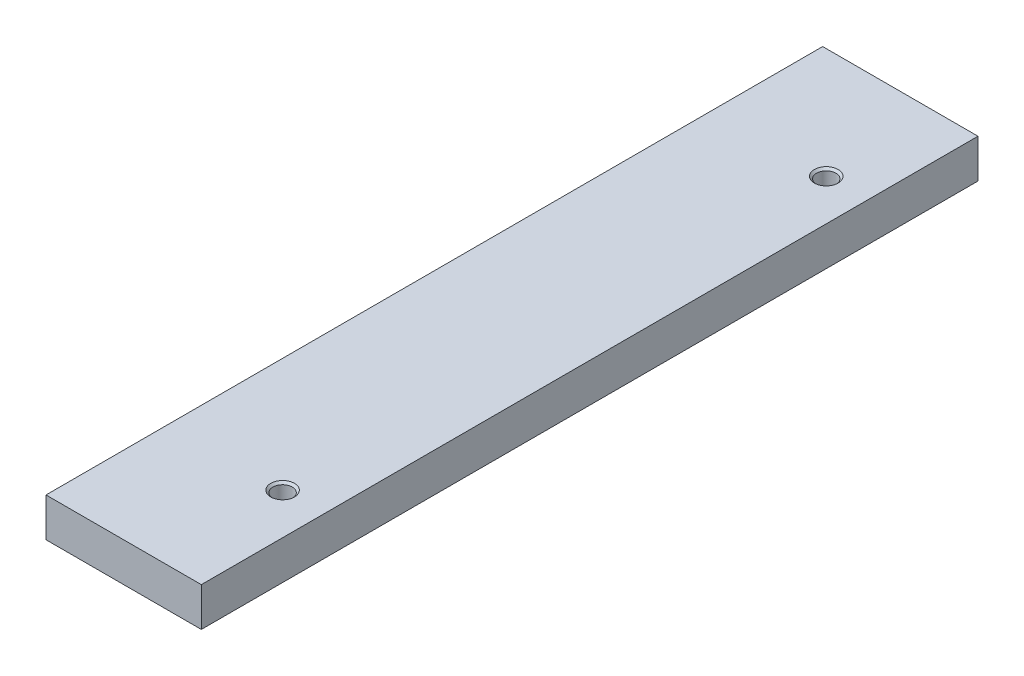
ISO-10303-21;
HEADER;
FILE_DESCRIPTION(('STEP AP214'),'2;1');
FILE_NAME('part.step','',(''),(''),'','','');
FILE_SCHEMA(('AUTOMOTIVE_DESIGN { 1 0 10303 214 1 1 1 1 }'));
ENDSEC;
DATA;
#1=APPLICATION_CONTEXT('core data for automotive mechanical design processes');
#2=APPLICATION_PROTOCOL_DEFINITION('international standard','automotive_design',2000,#1);
#3=PRODUCT_CONTEXT('',#1,'mechanical');
#4=PRODUCT('Part','Part','',(#3));
#5=PRODUCT_RELATED_PRODUCT_CATEGORY('part','',(#4));
#6=PRODUCT_DEFINITION_FORMATION('','',#4);
#7=PRODUCT_DEFINITION_CONTEXT('part definition',#1,'design');
#8=PRODUCT_DEFINITION('design','',#6,#7);
#9=PRODUCT_DEFINITION_SHAPE('','',#8);
#10=(LENGTH_UNIT() NAMED_UNIT(*) SI_UNIT(.MILLI.,.METRE.));
#11=(NAMED_UNIT(*) PLANE_ANGLE_UNIT() SI_UNIT($,.RADIAN.));
#12=(NAMED_UNIT(*) SI_UNIT($,.STERADIAN.) SOLID_ANGLE_UNIT());
#13=UNCERTAINTY_MEASURE_WITH_UNIT(LENGTH_MEASURE(1.E-05),#10,'distance_accuracy_value','');
#14=(GEOMETRIC_REPRESENTATION_CONTEXT(3) GLOBAL_UNCERTAINTY_ASSIGNED_CONTEXT((#13)) GLOBAL_UNIT_ASSIGNED_CONTEXT((#10,
#11,#12)) REPRESENTATION_CONTEXT('',''));
#15=CARTESIAN_POINT('',(0.,0.,0.));
#16=DIRECTION('',(0.,0.,1.));
#17=DIRECTION('',(1.,0.,0.));
#18=AXIS2_PLACEMENT_3D('',#15,#16,#17);
#19=CARTESIAN_POINT('',(10.,-2.5,100.));
#20=DIRECTION('',(-1.,0.,0.));
#21=DIRECTION('',(0.,0.,1.));
#22=AXIS2_PLACEMENT_3D('',#19,#20,#21);
#23=PLANE('',#22);
#24=DIRECTION('',(0.,1.,0.));
#25=VECTOR('',#24,1.);
#26=CARTESIAN_POINT('',(10.,-2.5,0.));
#27=LINE('',#26,#25);
#28=CARTESIAN_POINT('',(10.,-2.5,0.));
#29=VERTEX_POINT('',#28);
#30=CARTESIAN_POINT('',(10.,2.5,0.));
#31=VERTEX_POINT('',#30);
#32=EDGE_CURVE('E114',#29,#31,#27,.T.);
#33=ORIENTED_EDGE('',*,*,#32,.T.);
#34=DIRECTION('',(0.,0.,-1.));
#35=VECTOR('',#34,1.);
#36=CARTESIAN_POINT('',(10.,2.5,100.));
#37=LINE('',#36,#35);
#38=CARTESIAN_POINT('',(10.,2.5,100.));
#39=VERTEX_POINT('',#38);
#40=EDGE_CURVE('E11',#39,#31,#37,.T.);
#41=ORIENTED_EDGE('',*,*,#40,.F.);
#42=DIRECTION('',(0.,1.,0.));
#43=VECTOR('',#42,1.);
#44=CARTESIAN_POINT('',(10.,-2.5,100.));
#45=LINE('',#44,#43);
#46=CARTESIAN_POINT('',(10.,-2.5,100.));
#47=VERTEX_POINT('',#46);
#48=EDGE_CURVE('E102',#47,#39,#45,.T.);
#49=ORIENTED_EDGE('',*,*,#48,.F.);
#50=DIRECTION('',(0.,0.,-1.));
#51=VECTOR('',#50,1.);
#52=CARTESIAN_POINT('',(10.,-2.5,100.));
#53=LINE('',#52,#51);
#54=EDGE_CURVE('E110',#47,#29,#53,.T.);
#55=ORIENTED_EDGE('',*,*,#54,.T.);
#56=EDGE_LOOP('',(#33,#41,#49,#55));
#57=FACE_BOUND('',#56,.T.);
#58=ADVANCED_FACE('F51',(#57),#23,.F.);
#59=CARTESIAN_POINT('',(-9.99999999999999,2.5,100.));
#60=DIRECTION('',(0.,-1.,0.));
#61=DIRECTION('',(0.,0.,-1.));
#62=AXIS2_PLACEMENT_3D('',#59,#60,#61);
#63=PLANE('',#62);
#64=CARTESIAN_POINT('',(4.69882100750269,2.5,84.2364415862808));
#65=DIRECTION('',(0.,1.,0.));
#66=DIRECTION('',(0.,0.,1.));
#67=AXIS2_PLACEMENT_3D('',#64,#65,#66);
#68=CIRCLE('',#67,1.525);
#69=CARTESIAN_POINT('',(4.69882100750269,2.5,85.7614415862808));
#70=VERTEX_POINT('',#69);
#71=EDGE_CURVE('E142',#70,#70,#68,.T.);
#72=ORIENTED_EDGE('',*,*,#71,.F.);
#73=EDGE_LOOP('',(#72));
#74=FACE_BOUND('',#73,.T.);
#75=CARTESIAN_POINT('',(4.69882100750269,2.5,14.2364415862808));
#76=DIRECTION('',(0.,1.,0.));
#77=DIRECTION('',(0.,0.,1.));
#78=AXIS2_PLACEMENT_3D('',#75,#76,#77);
#79=CIRCLE('',#78,1.525);
#80=CARTESIAN_POINT('',(4.69882100750269,2.5,15.7614415862808));
#81=VERTEX_POINT('',#80);
#82=EDGE_CURVE('E133',#81,#81,#79,.T.);
#83=ORIENTED_EDGE('',*,*,#82,.F.);
#84=EDGE_LOOP('',(#83));
#85=FACE_BOUND('',#84,.T.);
#86=DIRECTION('',(-1.,0.,0.));
#87=VECTOR('',#86,1.);
#88=CARTESIAN_POINT('',(-9.99999999999999,2.5,0.));
#89=LINE('',#88,#87);
#90=CARTESIAN_POINT('',(-9.99999999999999,2.5,0.));
#91=VERTEX_POINT('',#90);
#92=EDGE_CURVE('E106',#31,#91,#89,.T.);
#93=ORIENTED_EDGE('',*,*,#92,.T.);
#94=DIRECTION('',(0.,0.,-1.));
#95=VECTOR('',#94,1.);
#96=CARTESIAN_POINT('',(-9.99999999999999,2.5,100.));
#97=LINE('',#96,#95);
#98=CARTESIAN_POINT('',(-9.99999999999999,2.5,100.));
#99=VERTEX_POINT('',#98);
#100=EDGE_CURVE('E59',#99,#91,#97,.T.);
#101=ORIENTED_EDGE('',*,*,#100,.F.);
#102=DIRECTION('',(-1.,0.,0.));
#103=VECTOR('',#102,1.);
#104=CARTESIAN_POINT('',(-9.99999999999999,2.5,100.));
#105=LINE('',#104,#103);
#106=EDGE_CURVE('E97',#39,#99,#105,.T.);
#107=ORIENTED_EDGE('',*,*,#106,.F.);
#108=ORIENTED_EDGE('',*,*,#40,.T.);
#109=EDGE_LOOP('',(#93,#101,#107,#108));
#110=FACE_BOUND('',#109,.T.);
#111=ADVANCED_FACE('F105',(#74,#85,#110),#63,.F.);
#112=CARTESIAN_POINT('',(-9.99999999999999,-2.5,100.));
#113=DIRECTION('',(1.,0.,0.));
#114=DIRECTION('',(0.,0.,-1.));
#115=AXIS2_PLACEMENT_3D('',#112,#113,#114);
#116=PLANE('',#115);
#117=DIRECTION('',(0.,-1.,0.));
#118=VECTOR('',#117,1.);
#119=CARTESIAN_POINT('',(-9.99999999999999,-2.5,0.));
#120=LINE('',#119,#118);
#121=CARTESIAN_POINT('',(-9.99999999999999,-2.5,0.));
#122=VERTEX_POINT('',#121);
#123=EDGE_CURVE('E84',#91,#122,#120,.T.);
#124=ORIENTED_EDGE('',*,*,#123,.T.);
#125=DIRECTION('',(0.,0.,-1.));
#126=VECTOR('',#125,1.);
#127=CARTESIAN_POINT('',(-9.99999999999999,-2.5,100.));
#128=LINE('',#127,#126);
#129=CARTESIAN_POINT('',(-9.99999999999999,-2.5,100.));
#130=VERTEX_POINT('',#129);
#131=EDGE_CURVE('E107',#130,#122,#128,.T.);
#132=ORIENTED_EDGE('',*,*,#131,.F.);
#133=DIRECTION('',(0.,-1.,0.));
#134=VECTOR('',#133,1.);
#135=CARTESIAN_POINT('',(-9.99999999999999,-2.5,100.));
#136=LINE('',#135,#134);
#137=EDGE_CURVE('E100',#99,#130,#136,.T.);
#138=ORIENTED_EDGE('',*,*,#137,.F.);
#139=ORIENTED_EDGE('',*,*,#100,.T.);
#140=EDGE_LOOP('',(#124,#132,#138,#139));
#141=FACE_BOUND('',#140,.T.);
#142=ADVANCED_FACE('F108',(#141),#116,.F.);
#143=CARTESIAN_POINT('',(-9.99999999999999,-2.5,100.));
#144=DIRECTION('',(0.,1.,0.));
#145=DIRECTION('',(0.,0.,1.));
#146=AXIS2_PLACEMENT_3D('',#143,#144,#145);
#147=PLANE('',#146);
#148=CARTESIAN_POINT('',(4.69882100750269,-2.5,84.2364415862808));
#149=DIRECTION('',(0.,1.,0.));
#150=DIRECTION('',(0.,0.,1.));
#151=AXIS2_PLACEMENT_3D('',#148,#149,#150);
#152=CIRCLE('',#151,1.24999999999999);
#153=CARTESIAN_POINT('',(4.69882100750269,-2.5,85.4864415862808));
#154=VERTEX_POINT('',#153);
#155=EDGE_CURVE('E139',#154,#154,#152,.T.);
#156=ORIENTED_EDGE('',*,*,#155,.T.);
#157=EDGE_LOOP('',(#156));
#158=FACE_BOUND('',#157,.T.);
#159=CARTESIAN_POINT('',(4.69882100750269,-2.5,14.2364415862808));
#160=DIRECTION('',(0.,1.,0.));
#161=DIRECTION('',(0.,0.,1.));
#162=AXIS2_PLACEMENT_3D('',#159,#160,#161);
#163=CIRCLE('',#162,1.24999999999999);
#164=CARTESIAN_POINT('',(4.69882100750269,-2.5,15.4864415862808));
#165=VERTEX_POINT('',#164);
#166=EDGE_CURVE('E117',#165,#165,#163,.T.);
#167=ORIENTED_EDGE('',*,*,#166,.T.);
#168=EDGE_LOOP('',(#167));
#169=FACE_BOUND('',#168,.T.);
#170=DIRECTION('',(1.,0.,0.));
#171=VECTOR('',#170,1.);
#172=CARTESIAN_POINT('',(-9.99999999999999,-2.5,0.));
#173=LINE('',#172,#171);
#174=EDGE_CURVE('E90',#122,#29,#173,.T.);
#175=ORIENTED_EDGE('',*,*,#174,.T.);
#176=ORIENTED_EDGE('',*,*,#54,.F.);
#177=DIRECTION('',(1.,0.,0.));
#178=VECTOR('',#177,1.);
#179=CARTESIAN_POINT('',(-9.99999999999999,-2.5,100.));
#180=LINE('',#179,#178);
#181=EDGE_CURVE('E67',#130,#47,#180,.T.);
#182=ORIENTED_EDGE('',*,*,#181,.F.);
#183=ORIENTED_EDGE('',*,*,#131,.T.);
#184=EDGE_LOOP('',(#175,#176,#182,#183));
#185=FACE_BOUND('',#184,.T.);
#186=ADVANCED_FACE('F122',(#158,#169,#185),#147,.F.);
#187=CARTESIAN_POINT('',(0.,0.,100.));
#188=DIRECTION('',(0.,0.,-1.));
#189=DIRECTION('',(-1.,0.,0.));
#190=AXIS2_PLACEMENT_3D('',#187,#188,#189);
#191=PLANE('',#190);
#192=ORIENTED_EDGE('',*,*,#48,.T.);
#193=ORIENTED_EDGE('',*,*,#106,.T.);
#194=ORIENTED_EDGE('',*,*,#137,.T.);
#195=ORIENTED_EDGE('',*,*,#181,.T.);
#196=EDGE_LOOP('',(#192,#193,#194,#195));
#197=FACE_BOUND('',#196,.T.);
#198=ADVANCED_FACE('F98',(#197),#191,.F.);
#199=CARTESIAN_POINT('',(0.,0.,0.));
#200=DIRECTION('',(0.,0.,-1.));
#201=DIRECTION('',(-1.,0.,0.));
#202=AXIS2_PLACEMENT_3D('',#199,#200,#201);
#203=PLANE('',#202);
#204=ORIENTED_EDGE('',*,*,#32,.F.);
#205=ORIENTED_EDGE('',*,*,#174,.F.);
#206=ORIENTED_EDGE('',*,*,#123,.F.);
#207=ORIENTED_EDGE('',*,*,#92,.F.);
#208=EDGE_LOOP('',(#204,#205,#206,#207));
#209=FACE_BOUND('',#208,.T.);
#210=ADVANCED_FACE('F125',(#209),#203,.T.);
#211=CARTESIAN_POINT('',(4.69882100750269,2.5,14.2364415862808));
#212=DIRECTION('',(0.,1.,0.));
#213=DIRECTION('',(0.,0.,1.));
#214=AXIS2_PLACEMENT_3D('',#211,#212,#213);
#215=CYLINDRICAL_SURFACE('',#214,1.24999999999999);
#216=ORIENTED_EDGE('',*,*,#166,.F.);
#217=EDGE_LOOP('',(#216));
#218=FACE_BOUND('',#217,.T.);
#219=CARTESIAN_POINT('',(4.69882100750269,2.22499999999999,14.2364415862808));
#220=DIRECTION('',(0.,1.,0.));
#221=DIRECTION('',(0.,0.,1.));
#222=AXIS2_PLACEMENT_3D('',#219,#220,#221);
#223=CIRCLE('',#222,1.24999999999999);
#224=CARTESIAN_POINT('',(4.69882100750269,2.22499999999999,15.4864415862808));
#225=VERTEX_POINT('',#224);
#226=EDGE_CURVE('E130',#225,#225,#223,.T.);
#227=ORIENTED_EDGE('',*,*,#226,.T.);
#228=EDGE_LOOP('',(#227));
#229=FACE_BOUND('',#228,.T.);
#230=ADVANCED_FACE('F155',(#218,#229),#215,.F.);
#231=CARTESIAN_POINT('',(4.69882100750269,2.5,14.2364415862808));
#232=DIRECTION('',(0.,1.,0.));
#233=DIRECTION('',(0.,0.,1.));
#234=AXIS2_PLACEMENT_3D('',#231,#232,#233);
#235=CONICAL_SURFACE('',#234,1.525,0.785398163397448);
#236=ORIENTED_EDGE('',*,*,#226,.F.);
#237=EDGE_LOOP('',(#236));
#238=FACE_BOUND('',#237,.T.);
#239=ORIENTED_EDGE('',*,*,#82,.T.);
#240=EDGE_LOOP('',(#239));
#241=FACE_BOUND('',#240,.T.);
#242=ADVANCED_FACE('F152',(#238,#241),#235,.F.);
#243=CARTESIAN_POINT('',(4.69882100750269,2.5,84.2364415862808));
#244=DIRECTION('',(0.,1.,0.));
#245=DIRECTION('',(0.,0.,1.));
#246=AXIS2_PLACEMENT_3D('',#243,#244,#245);
#247=CYLINDRICAL_SURFACE('',#246,1.24999999999999);
#248=ORIENTED_EDGE('',*,*,#155,.F.);
#249=EDGE_LOOP('',(#248));
#250=FACE_BOUND('',#249,.T.);
#251=CARTESIAN_POINT('',(4.69882100750269,2.22499999999999,84.2364415862808));
#252=DIRECTION('',(0.,1.,0.));
#253=DIRECTION('',(0.,0.,1.));
#254=AXIS2_PLACEMENT_3D('',#251,#252,#253);
#255=CIRCLE('',#254,1.24999999999999);
#256=CARTESIAN_POINT('',(4.69882100750269,2.22499999999999,85.4864415862808));
#257=VERTEX_POINT('',#256);
#258=EDGE_CURVE('E136',#257,#257,#255,.T.);
#259=ORIENTED_EDGE('',*,*,#258,.T.);
#260=EDGE_LOOP('',(#259));
#261=FACE_BOUND('',#260,.T.);
#262=ADVANCED_FACE('F154',(#250,#261),#247,.F.);
#263=CARTESIAN_POINT('',(4.69882100750269,2.5,84.2364415862808));
#264=DIRECTION('',(0.,1.,0.));
#265=DIRECTION('',(0.,0.,1.));
#266=AXIS2_PLACEMENT_3D('',#263,#264,#265);
#267=CONICAL_SURFACE('',#266,1.525,0.785398163397448);
#268=ORIENTED_EDGE('',*,*,#258,.F.);
#269=EDGE_LOOP('',(#268));
#270=FACE_BOUND('',#269,.T.);
#271=ORIENTED_EDGE('',*,*,#71,.T.);
#272=EDGE_LOOP('',(#271));
#273=FACE_BOUND('',#272,.T.);
#274=ADVANCED_FACE('F146',(#270,#273),#267,.F.);
#275=CLOSED_SHELL('',(#58,#111,#142,#186,#198,#210,#230,#242,#262,#274));
#276=MANIFOLD_SOLID_BREP('B2',#275);
#277=ADVANCED_BREP_SHAPE_REPRESENTATION('',(#18,#276),#14);
#278=SHAPE_DEFINITION_REPRESENTATION(#9,#277);
ENDSEC;
END-ISO-10303-21;
